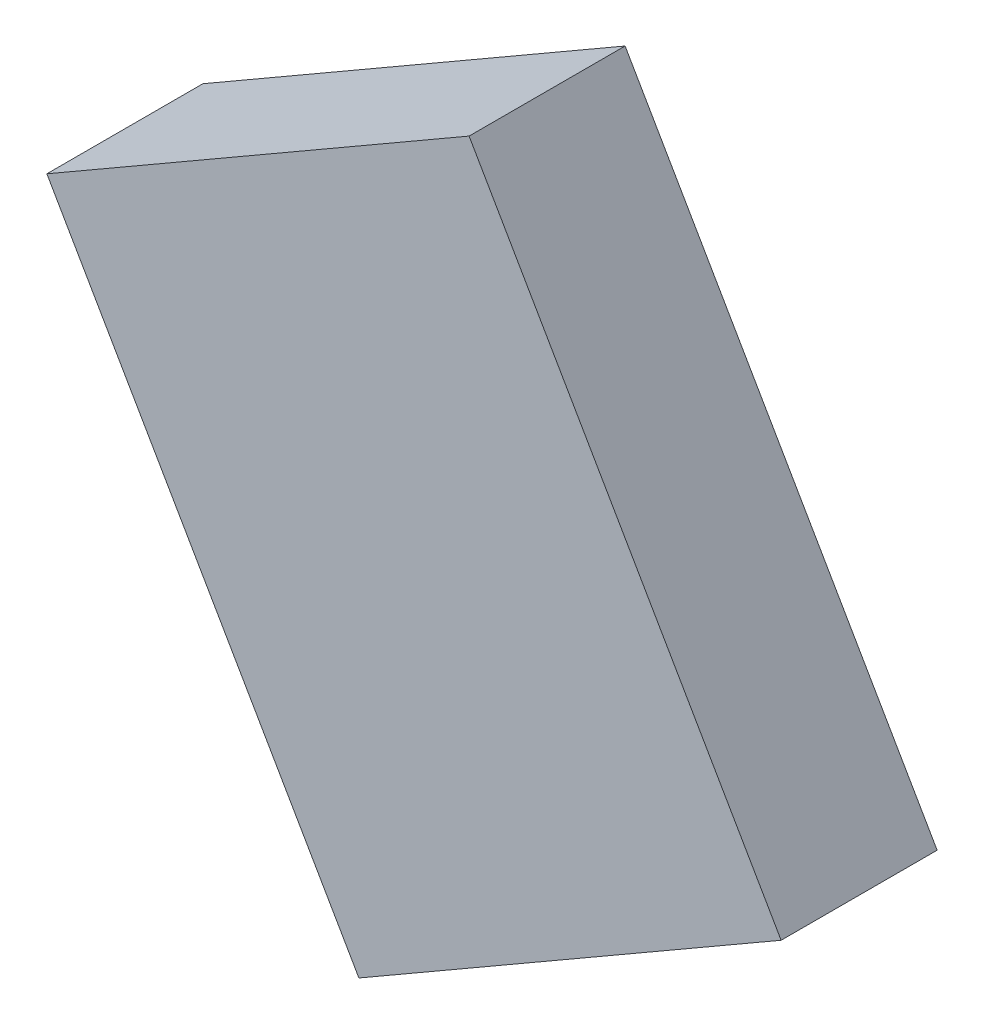
ISO-10303-21;
HEADER;
FILE_DESCRIPTION(('STEP AP214'),'2;1');
FILE_NAME('part.step','',(''),(''),'','','');
FILE_SCHEMA(('AUTOMOTIVE_DESIGN { 1 0 10303 214 1 1 1 1 }'));
ENDSEC;
DATA;
#1=APPLICATION_CONTEXT('core data for automotive mechanical design processes');
#2=APPLICATION_PROTOCOL_DEFINITION('international standard','automotive_design',2000,#1);
#3=PRODUCT_CONTEXT('',#1,'mechanical');
#4=PRODUCT('Part','Part','',(#3));
#5=PRODUCT_RELATED_PRODUCT_CATEGORY('part','',(#4));
#6=PRODUCT_DEFINITION_FORMATION('','',#4);
#7=PRODUCT_DEFINITION_CONTEXT('part definition',#1,'design');
#8=PRODUCT_DEFINITION('design','',#6,#7);
#9=PRODUCT_DEFINITION_SHAPE('','',#8);
#10=(LENGTH_UNIT() NAMED_UNIT(*) SI_UNIT(.MILLI.,.METRE.));
#11=(NAMED_UNIT(*) PLANE_ANGLE_UNIT() SI_UNIT($,.RADIAN.));
#12=(NAMED_UNIT(*) SI_UNIT($,.STERADIAN.) SOLID_ANGLE_UNIT());
#13=UNCERTAINTY_MEASURE_WITH_UNIT(LENGTH_MEASURE(1.E-05),#10,'distance_accuracy_value','');
#14=(GEOMETRIC_REPRESENTATION_CONTEXT(3) GLOBAL_UNCERTAINTY_ASSIGNED_CONTEXT((#13)) GLOBAL_UNIT_ASSIGNED_CONTEXT((#10,
#11,#12)) REPRESENTATION_CONTEXT('',''));
#15=CARTESIAN_POINT('',(0.,0.,0.));
#16=DIRECTION('',(0.,0.,1.));
#17=DIRECTION('',(1.,0.,0.));
#18=AXIS2_PLACEMENT_3D('',#15,#16,#17);
#19=CARTESIAN_POINT('',(1.88253116,-0.7606411,0.80000094));
#20=DIRECTION('',(0.,0.,-1.));
#21=DIRECTION('',(-1.,0.,0.));
#22=AXIS2_PLACEMENT_3D('',#19,#20,#21);
#23=PLANE('',#22);
#24=DIRECTION('',(0.866024649968043,0.500001305646025,0.));
#25=VECTOR('',#24,1.);
#26=CARTESIAN_POINT('',(0.28252928,2.01064368,0.80000094));
#27=LINE('',#26,#25);
#28=CARTESIAN_POINT('',(0.282529280000118,2.01064368000007,0.80000094));
#29=VERTEX_POINT('',#28);
#30=CARTESIAN_POINT('',(-1.88253116000014,0.760641100000237,0.80000094));
#31=VERTEX_POINT('',#30);
#32=EDGE_CURVE('E55',#29,#31,#27,.F.);
#33=ORIENTED_EDGE('',*,*,#32,.T.);
#34=DIRECTION('',(-0.499999717047159,0.866025567147276,0.));
#35=VECTOR('',#34,1.);
#36=CARTESIAN_POINT('',(-1.88253116,0.7606411,0.80000094));
#37=LINE('',#36,#35);
#38=CARTESIAN_POINT('',(-0.282531820000205,-2.01064114000012,0.80000094));
#39=VERTEX_POINT('',#38);
#40=EDGE_CURVE('E57',#31,#39,#37,.F.);
#41=ORIENTED_EDGE('',*,*,#40,.T.);
#42=DIRECTION('',(-0.866025343910241,-0.500000103705139,0.));
#43=VECTOR('',#42,1.);
#44=CARTESIAN_POINT('',(-0.28253182,-2.01064114,0.80000094));
#45=LINE('',#44,#43);
#46=CARTESIAN_POINT('',(1.88253116000016,-0.760641100000285,0.80000094));
#47=VERTEX_POINT('',#46);
#48=EDGE_CURVE('E20',#39,#47,#45,.F.);
#49=ORIENTED_EDGE('',*,*,#48,.T.);
#50=DIRECTION('',(0.499999968655959,-0.866025421880929,0.));
#51=VECTOR('',#50,1.);
#52=CARTESIAN_POINT('',(1.88253116,-0.7606411,0.80000094));
#53=LINE('',#52,#51);
#54=EDGE_CURVE('E80',#47,#29,#53,.F.);
#55=ORIENTED_EDGE('',*,*,#54,.T.);
#56=EDGE_LOOP('',(#33,#41,#49,#55));
#57=FACE_BOUND('',#56,.T.);
#58=ADVANCED_FACE('F17',(#57),#23,.F.);
#59=CARTESIAN_POINT('',(-0.28253182,-2.01064114,0.));
#60=DIRECTION('',(-0.500000103705139,0.866025343910241,0.));
#61=DIRECTION('',(-0.866025343910241,-0.500000103705139,0.));
#62=AXIS2_PLACEMENT_3D('',#59,#60,#61);
#63=PLANE('',#62);
#64=DIRECTION('',(0.,0.,1.));
#65=VECTOR('',#64,1.);
#66=CARTESIAN_POINT('',(1.88253116,-0.7606411,0.));
#67=LINE('',#66,#65);
#68=CARTESIAN_POINT('',(1.88253116000016,-0.760641100000285,0.));
#69=VERTEX_POINT('',#68);
#70=EDGE_CURVE('E68',#69,#47,#67,.T.);
#71=ORIENTED_EDGE('',*,*,#70,.T.);
#72=ORIENTED_EDGE('',*,*,#48,.F.);
#73=DIRECTION('',(0.,0.,1.));
#74=VECTOR('',#73,1.);
#75=CARTESIAN_POINT('',(-0.282531820000822,-2.01064114000048,0.));
#76=LINE('',#75,#74);
#77=CARTESIAN_POINT('',(-0.282531820000205,-2.01064114000012,0.));
#78=VERTEX_POINT('',#77);
#79=EDGE_CURVE('E63',#39,#78,#76,.F.);
#80=ORIENTED_EDGE('',*,*,#79,.T.);
#81=DIRECTION('',(-0.866025343910109,-0.500000103705367,0.));
#82=VECTOR('',#81,1.);
#83=CARTESIAN_POINT('',(1.88253116,-0.7606411,0.));
#84=LINE('',#83,#82);
#85=EDGE_CURVE('E83',#69,#78,#84,.T.);
#86=ORIENTED_EDGE('',*,*,#85,.F.);
#87=EDGE_LOOP('',(#71,#72,#80,#86));
#88=FACE_BOUND('',#87,.T.);
#89=ADVANCED_FACE('F65',(#88),#63,.F.);
#90=CARTESIAN_POINT('',(-1.88253116,0.7606411,0.));
#91=DIRECTION('',(0.866025567147276,0.499999717047159,0.));
#92=DIRECTION('',(-0.499999717047159,0.866025567147276,0.));
#93=AXIS2_PLACEMENT_3D('',#90,#91,#92);
#94=PLANE('',#93);
#95=ORIENTED_EDGE('',*,*,#79,.F.);
#96=ORIENTED_EDGE('',*,*,#40,.F.);
#97=DIRECTION('',(0.,0.,1.));
#98=VECTOR('',#97,1.);
#99=CARTESIAN_POINT('',(-1.88253116000055,0.760641100000947,0.));
#100=LINE('',#99,#98);
#101=CARTESIAN_POINT('',(-1.88253116000014,0.760641100000237,0.));
#102=VERTEX_POINT('',#101);
#103=EDGE_CURVE('E75',#31,#102,#100,.F.);
#104=ORIENTED_EDGE('',*,*,#103,.T.);
#105=DIRECTION('',(-0.499999717047416,0.866025567147127,0.));
#106=VECTOR('',#105,1.);
#107=CARTESIAN_POINT('',(-0.28253182,-2.01064114,0.));
#108=LINE('',#107,#106);
#109=EDGE_CURVE('E72',#78,#102,#108,.T.);
#110=ORIENTED_EDGE('',*,*,#109,.F.);
#111=EDGE_LOOP('',(#95,#96,#104,#110));
#112=FACE_BOUND('',#111,.T.);
#113=ADVANCED_FACE('F70',(#112),#94,.F.);
#114=CARTESIAN_POINT('',(0.28252928,2.01064368,0.));
#115=DIRECTION('',(0.500001305646025,-0.866024649968043,0.));
#116=DIRECTION('',(0.866024649968043,0.500001305646025,0.));
#117=AXIS2_PLACEMENT_3D('',#114,#115,#116);
#118=PLANE('',#117);
#119=ORIENTED_EDGE('',*,*,#103,.F.);
#120=ORIENTED_EDGE('',*,*,#32,.F.);
#121=DIRECTION('',(0.,0.,1.));
#122=VECTOR('',#121,1.);
#123=CARTESIAN_POINT('',(0.28252928000047,2.01064368000027,0.));
#124=LINE('',#123,#122);
#125=CARTESIAN_POINT('',(0.282529280000118,2.01064368000007,0.));
#126=VERTEX_POINT('',#125);
#127=EDGE_CURVE('E35',#29,#126,#124,.F.);
#128=ORIENTED_EDGE('',*,*,#127,.T.);
#129=DIRECTION('',(0.866024649967824,0.500001305646403,0.));
#130=VECTOR('',#129,1.);
#131=CARTESIAN_POINT('',(-1.88253116,0.7606411,0.));
#132=LINE('',#131,#130);
#133=EDGE_CURVE('E26',#102,#126,#132,.T.);
#134=ORIENTED_EDGE('',*,*,#133,.F.);
#135=EDGE_LOOP('',(#119,#120,#128,#134));
#136=FACE_BOUND('',#135,.T.);
#137=ADVANCED_FACE('F89',(#136),#118,.F.);
#138=CARTESIAN_POINT('',(1.88253116,-0.7606411,0.));
#139=DIRECTION('',(-0.866025421880929,-0.499999968655959,0.));
#140=DIRECTION('',(0.499999968655959,-0.866025421880929,0.));
#141=AXIS2_PLACEMENT_3D('',#138,#139,#140);
#142=PLANE('',#141);
#143=ORIENTED_EDGE('',*,*,#127,.F.);
#144=ORIENTED_EDGE('',*,*,#54,.F.);
#145=ORIENTED_EDGE('',*,*,#70,.F.);
#146=DIRECTION('',(0.499999968656106,-0.866025421880844,0.));
#147=VECTOR('',#146,1.);
#148=CARTESIAN_POINT('',(0.28252928,2.01064368,0.));
#149=LINE('',#148,#147);
#150=EDGE_CURVE('E11',#126,#69,#149,.T.);
#151=ORIENTED_EDGE('',*,*,#150,.F.);
#152=EDGE_LOOP('',(#143,#144,#145,#151));
#153=FACE_BOUND('',#152,.T.);
#154=ADVANCED_FACE('F91',(#153),#142,.F.);
#155=CARTESIAN_POINT('',(1.88253116,-0.7606411,0.));
#156=DIRECTION('',(0.,0.,-1.));
#157=DIRECTION('',(-1.,0.,0.));
#158=AXIS2_PLACEMENT_3D('',#155,#156,#157);
#159=PLANE('',#158);
#160=ORIENTED_EDGE('',*,*,#133,.T.);
#161=ORIENTED_EDGE('',*,*,#150,.T.);
#162=ORIENTED_EDGE('',*,*,#85,.T.);
#163=ORIENTED_EDGE('',*,*,#109,.T.);
#164=EDGE_LOOP('',(#160,#161,#162,#163));
#165=FACE_BOUND('',#164,.T.);
#166=ADVANCED_FACE('F88',(#165),#159,.T.);
#167=CLOSED_SHELL('',(#58,#89,#113,#137,#154,#166));
#168=MANIFOLD_SOLID_BREP('B1',#167);
#169=ADVANCED_BREP_SHAPE_REPRESENTATION('',(#18,#168),#14);
#170=SHAPE_DEFINITION_REPRESENTATION(#9,#169);
ENDSEC;
END-ISO-10303-21;
